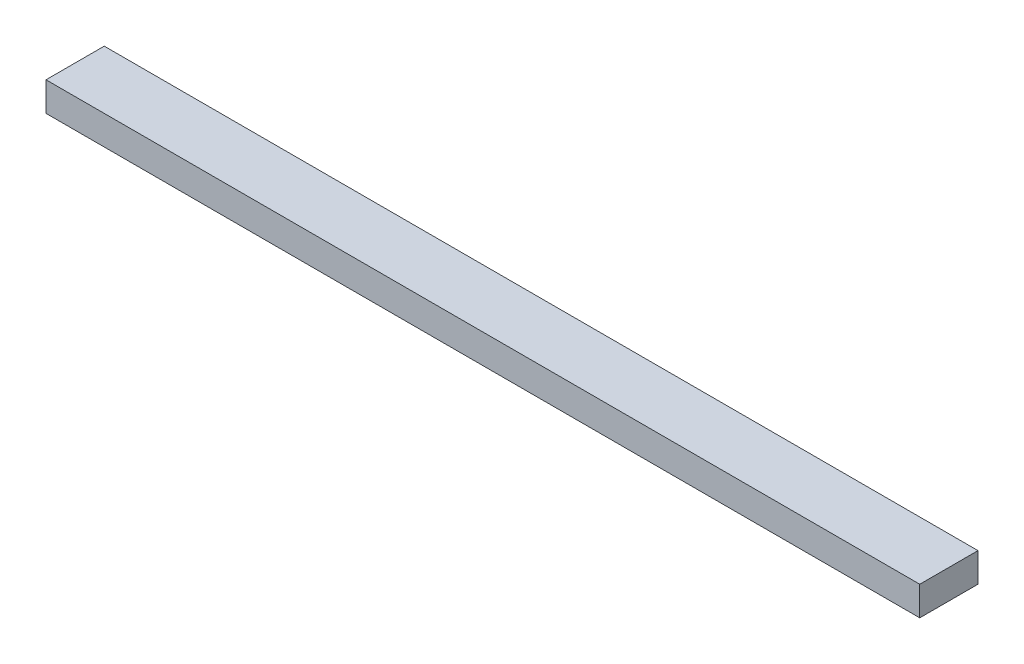
ISO-10303-21;
HEADER;
FILE_DESCRIPTION(('STEP AP214'),'2;1');
FILE_NAME('part.step','',(''),(''),'','','');
FILE_SCHEMA(('AUTOMOTIVE_DESIGN { 1 0 10303 214 1 1 1 1 }'));
ENDSEC;
DATA;
#1=APPLICATION_CONTEXT('core data for automotive mechanical design processes');
#2=APPLICATION_PROTOCOL_DEFINITION('international standard','automotive_design',2000,#1);
#3=PRODUCT_CONTEXT('',#1,'mechanical');
#4=PRODUCT('Part','Part','',(#3));
#5=PRODUCT_RELATED_PRODUCT_CATEGORY('part','',(#4));
#6=PRODUCT_DEFINITION_FORMATION('','',#4);
#7=PRODUCT_DEFINITION_CONTEXT('part definition',#1,'design');
#8=PRODUCT_DEFINITION('design','',#6,#7);
#9=PRODUCT_DEFINITION_SHAPE('','',#8);
#10=(LENGTH_UNIT() NAMED_UNIT(*) SI_UNIT(.MILLI.,.METRE.));
#11=(NAMED_UNIT(*) PLANE_ANGLE_UNIT() SI_UNIT($,.RADIAN.));
#12=(NAMED_UNIT(*) SI_UNIT($,.STERADIAN.) SOLID_ANGLE_UNIT());
#13=UNCERTAINTY_MEASURE_WITH_UNIT(LENGTH_MEASURE(1.E-05),#10,'distance_accuracy_value','');
#14=(GEOMETRIC_REPRESENTATION_CONTEXT(3) GLOBAL_UNCERTAINTY_ASSIGNED_CONTEXT((#13)) GLOBAL_UNIT_ASSIGNED_CONTEXT((#10,
#11,#12)) REPRESENTATION_CONTEXT('',''));
#15=CARTESIAN_POINT('',(0.,0.,0.));
#16=DIRECTION('',(0.,0.,1.));
#17=DIRECTION('',(1.,0.,0.));
#18=AXIS2_PLACEMENT_3D('',#15,#16,#17);
#19=CARTESIAN_POINT('',(-84.0557275541796,5.,-15.5727554179567));
#20=DIRECTION('',(1.,0.,0.));
#21=DIRECTION('',(0.,0.,-1.));
#22=AXIS2_PLACEMENT_3D('',#19,#20,#21);
#23=PLANE('',#22);
#24=DIRECTION('',(0.,0.,1.));
#25=VECTOR('',#24,1.);
#26=CARTESIAN_POINT('',(-84.0557275541796,0.,-15.5727554179567));
#27=LINE('',#26,#25);
#28=CARTESIAN_POINT('',(-84.0557275541796,0.,-15.5727554179567));
#29=VERTEX_POINT('',#28);
#30=CARTESIAN_POINT('',(-84.0557275541795,0.,-5.57275541795665));
#31=VERTEX_POINT('',#30);
#32=EDGE_CURVE('E96',#29,#31,#27,.T.);
#33=ORIENTED_EDGE('',*,*,#32,.T.);
#34=DIRECTION('',(0.,-1.,0.));
#35=VECTOR('',#34,1.);
#36=CARTESIAN_POINT('',(-84.0557275541795,5.,-5.57275541795665));
#37=LINE('',#36,#35);
#38=CARTESIAN_POINT('',(-84.0557275541795,5.,-5.57275541795665));
#39=VERTEX_POINT('',#38);
#40=EDGE_CURVE('E11',#39,#31,#37,.T.);
#41=ORIENTED_EDGE('',*,*,#40,.F.);
#42=DIRECTION('',(0.,0.,1.));
#43=VECTOR('',#42,1.);
#44=CARTESIAN_POINT('',(-84.0557275541796,5.,-15.5727554179567));
#45=LINE('',#44,#43);
#46=CARTESIAN_POINT('',(-84.0557275541796,5.,-15.5727554179567));
#47=VERTEX_POINT('',#46);
#48=EDGE_CURVE('E84',#47,#39,#45,.T.);
#49=ORIENTED_EDGE('',*,*,#48,.F.);
#50=DIRECTION('',(0.,-1.,0.));
#51=VECTOR('',#50,1.);
#52=CARTESIAN_POINT('',(-84.0557275541796,5.,-15.5727554179567));
#53=LINE('',#52,#51);
#54=EDGE_CURVE('E92',#47,#29,#53,.T.);
#55=ORIENTED_EDGE('',*,*,#54,.T.);
#56=EDGE_LOOP('',(#33,#41,#49,#55));
#57=FACE_BOUND('',#56,.T.);
#58=ADVANCED_FACE('F33',(#57),#23,.F.);
#59=CARTESIAN_POINT('',(-84.0557275541795,5.,-5.57275541795665));
#60=DIRECTION('',(0.,0.,-1.));
#61=DIRECTION('',(-1.,0.,0.));
#62=AXIS2_PLACEMENT_3D('',#59,#60,#61);
#63=PLANE('',#62);
#64=DIRECTION('',(1.,0.,0.));
#65=VECTOR('',#64,1.);
#66=CARTESIAN_POINT('',(-84.0557275541795,0.,-5.57275541795665));
#67=LINE('',#66,#65);
#68=CARTESIAN_POINT('',(65.9442724458204,0.,-5.57275541795665));
#69=VERTEX_POINT('',#68);
#70=EDGE_CURVE('E88',#31,#69,#67,.T.);
#71=ORIENTED_EDGE('',*,*,#70,.T.);
#72=DIRECTION('',(0.,-1.,0.));
#73=VECTOR('',#72,1.);
#74=CARTESIAN_POINT('',(65.9442724458204,5.,-5.57275541795665));
#75=LINE('',#74,#73);
#76=CARTESIAN_POINT('',(65.9442724458204,5.,-5.57275541795665));
#77=VERTEX_POINT('',#76);
#78=EDGE_CURVE('E41',#77,#69,#75,.T.);
#79=ORIENTED_EDGE('',*,*,#78,.F.);
#80=DIRECTION('',(1.,0.,0.));
#81=VECTOR('',#80,1.);
#82=CARTESIAN_POINT('',(-84.0557275541795,5.,-5.57275541795665));
#83=LINE('',#82,#81);
#84=EDGE_CURVE('E79',#39,#77,#83,.T.);
#85=ORIENTED_EDGE('',*,*,#84,.F.);
#86=ORIENTED_EDGE('',*,*,#40,.T.);
#87=EDGE_LOOP('',(#71,#79,#85,#86));
#88=FACE_BOUND('',#87,.T.);
#89=ADVANCED_FACE('F87',(#88),#63,.F.);
#90=CARTESIAN_POINT('',(65.9442724458204,5.,-15.5727554179567));
#91=DIRECTION('',(-1.,0.,0.));
#92=DIRECTION('',(0.,0.,1.));
#93=AXIS2_PLACEMENT_3D('',#90,#91,#92);
#94=PLANE('',#93);
#95=DIRECTION('',(0.,0.,-1.));
#96=VECTOR('',#95,1.);
#97=CARTESIAN_POINT('',(65.9442724458204,0.,-15.5727554179567));
#98=LINE('',#97,#96);
#99=CARTESIAN_POINT('',(65.9442724458204,0.,-15.5727554179567));
#100=VERTEX_POINT('',#99);
#101=EDGE_CURVE('E66',#69,#100,#98,.T.);
#102=ORIENTED_EDGE('',*,*,#101,.T.);
#103=DIRECTION('',(0.,-1.,0.));
#104=VECTOR('',#103,1.);
#105=CARTESIAN_POINT('',(65.9442724458204,5.,-15.5727554179567));
#106=LINE('',#105,#104);
#107=CARTESIAN_POINT('',(65.9442724458204,5.,-15.5727554179567));
#108=VERTEX_POINT('',#107);
#109=EDGE_CURVE('E89',#108,#100,#106,.T.);
#110=ORIENTED_EDGE('',*,*,#109,.F.);
#111=DIRECTION('',(0.,0.,-1.));
#112=VECTOR('',#111,1.);
#113=CARTESIAN_POINT('',(65.9442724458204,5.,-15.5727554179567));
#114=LINE('',#113,#112);
#115=EDGE_CURVE('E82',#77,#108,#114,.T.);
#116=ORIENTED_EDGE('',*,*,#115,.F.);
#117=ORIENTED_EDGE('',*,*,#78,.T.);
#118=EDGE_LOOP('',(#102,#110,#116,#117));
#119=FACE_BOUND('',#118,.T.);
#120=ADVANCED_FACE('F90',(#119),#94,.F.);
#121=CARTESIAN_POINT('',(-84.0557275541796,5.,-15.5727554179567));
#122=DIRECTION('',(0.,0.,1.));
#123=DIRECTION('',(1.,0.,0.));
#124=AXIS2_PLACEMENT_3D('',#121,#122,#123);
#125=PLANE('',#124);
#126=DIRECTION('',(-1.,0.,0.));
#127=VECTOR('',#126,1.);
#128=CARTESIAN_POINT('',(-84.0557275541796,0.,-15.5727554179567));
#129=LINE('',#128,#127);
#130=EDGE_CURVE('E72',#100,#29,#129,.T.);
#131=ORIENTED_EDGE('',*,*,#130,.T.);
#132=ORIENTED_EDGE('',*,*,#54,.F.);
#133=DIRECTION('',(-1.,0.,0.));
#134=VECTOR('',#133,1.);
#135=CARTESIAN_POINT('',(-84.0557275541796,5.,-15.5727554179567));
#136=LINE('',#135,#134);
#137=EDGE_CURVE('E49',#108,#47,#136,.T.);
#138=ORIENTED_EDGE('',*,*,#137,.F.);
#139=ORIENTED_EDGE('',*,*,#109,.T.);
#140=EDGE_LOOP('',(#131,#132,#138,#139));
#141=FACE_BOUND('',#140,.T.);
#142=ADVANCED_FACE('F103',(#141),#125,.F.);
#143=CARTESIAN_POINT('',(0.,5.,0.));
#144=DIRECTION('',(0.,1.,0.));
#145=DIRECTION('',(0.,0.,1.));
#146=AXIS2_PLACEMENT_3D('',#143,#144,#145);
#147=PLANE('',#146);
#148=ORIENTED_EDGE('',*,*,#48,.T.);
#149=ORIENTED_EDGE('',*,*,#84,.T.);
#150=ORIENTED_EDGE('',*,*,#115,.T.);
#151=ORIENTED_EDGE('',*,*,#137,.T.);
#152=EDGE_LOOP('',(#148,#149,#150,#151));
#153=FACE_BOUND('',#152,.T.);
#154=ADVANCED_FACE('F80',(#153),#147,.T.);
#155=CARTESIAN_POINT('',(0.,0.,0.));
#156=DIRECTION('',(0.,1.,0.));
#157=DIRECTION('',(0.,0.,1.));
#158=AXIS2_PLACEMENT_3D('',#155,#156,#157);
#159=PLANE('',#158);
#160=ORIENTED_EDGE('',*,*,#32,.F.);
#161=ORIENTED_EDGE('',*,*,#130,.F.);
#162=ORIENTED_EDGE('',*,*,#101,.F.);
#163=ORIENTED_EDGE('',*,*,#70,.F.);
#164=EDGE_LOOP('',(#160,#161,#162,#163));
#165=FACE_BOUND('',#164,.T.);
#166=ADVANCED_FACE('F106',(#165),#159,.F.);
#167=CLOSED_SHELL('',(#58,#89,#120,#142,#154,#166));
#168=MANIFOLD_SOLID_BREP('B2',#167);
#169=ADVANCED_BREP_SHAPE_REPRESENTATION('',(#18,#168),#14);
#170=SHAPE_DEFINITION_REPRESENTATION(#9,#169);
ENDSEC;
END-ISO-10303-21;
